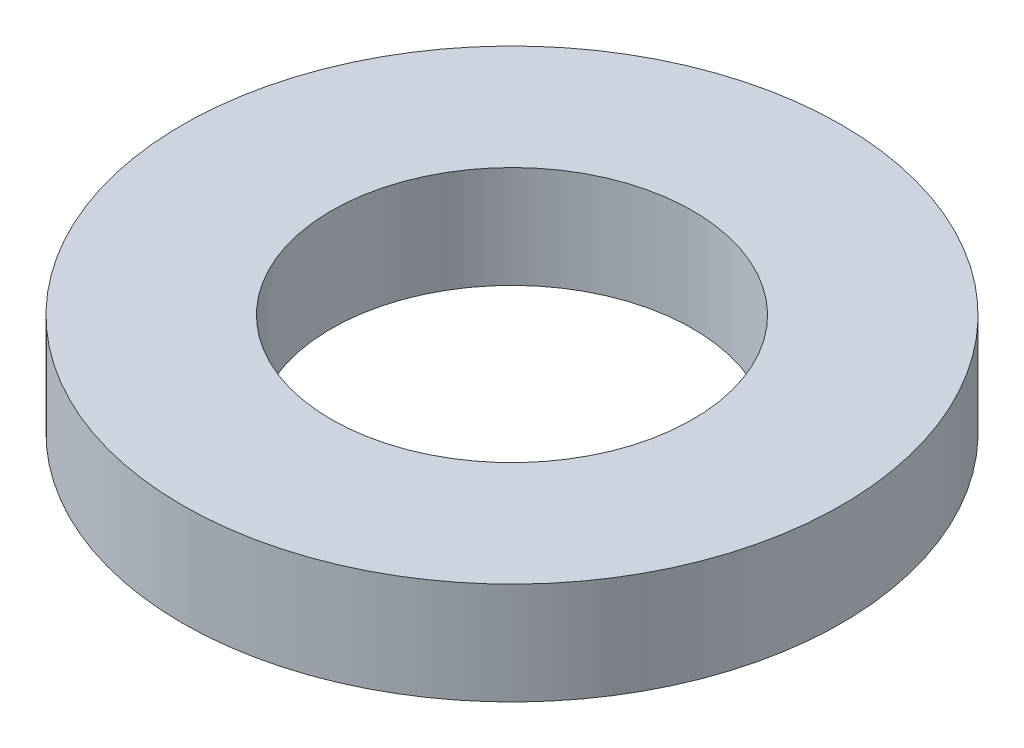
ISO-10303-21;
HEADER;
FILE_DESCRIPTION(('STEP AP214'),'2;1');
FILE_NAME('part.step','',(''),(''),'','','');
FILE_SCHEMA(('AUTOMOTIVE_DESIGN { 1 0 10303 214 1 1 1 1 }'));
ENDSEC;
DATA;
#1=APPLICATION_CONTEXT('core data for automotive mechanical design processes');
#2=APPLICATION_PROTOCOL_DEFINITION('international standard','automotive_design',2000,#1);
#3=PRODUCT_CONTEXT('',#1,'mechanical');
#4=PRODUCT('Part','Part','',(#3));
#5=PRODUCT_RELATED_PRODUCT_CATEGORY('part','',(#4));
#6=PRODUCT_DEFINITION_FORMATION('','',#4);
#7=PRODUCT_DEFINITION_CONTEXT('part definition',#1,'design');
#8=PRODUCT_DEFINITION('design','',#6,#7);
#9=PRODUCT_DEFINITION_SHAPE('','',#8);
#10=(LENGTH_UNIT() NAMED_UNIT(*) SI_UNIT(.MILLI.,.METRE.));
#11=(NAMED_UNIT(*) PLANE_ANGLE_UNIT() SI_UNIT($,.RADIAN.));
#12=(NAMED_UNIT(*) SI_UNIT($,.STERADIAN.) SOLID_ANGLE_UNIT());
#13=UNCERTAINTY_MEASURE_WITH_UNIT(LENGTH_MEASURE(1.E-05),#10,'distance_accuracy_value','');
#14=(GEOMETRIC_REPRESENTATION_CONTEXT(3) GLOBAL_UNCERTAINTY_ASSIGNED_CONTEXT((#13)) GLOBAL_UNIT_ASSIGNED_CONTEXT((#10,
#11,#12)) REPRESENTATION_CONTEXT('',''));
#15=CARTESIAN_POINT('',(0.,0.,0.));
#16=DIRECTION('',(0.,0.,1.));
#17=DIRECTION('',(1.,0.,0.));
#18=AXIS2_PLACEMENT_3D('',#15,#16,#17);
#19=CARTESIAN_POINT('',(0.,24.,0.));
#20=DIRECTION('',(0.,-1.,0.));
#21=DIRECTION('',(0.,0.,-1.));
#22=AXIS2_PLACEMENT_3D('',#19,#20,#21);
#23=CYLINDRICAL_SURFACE('',#22,77.5);
#24=CARTESIAN_POINT('',(0.,24.,0.));
#25=DIRECTION('',(0.,1.,0.));
#26=DIRECTION('',(0.,0.,1.));
#27=AXIS2_PLACEMENT_3D('',#24,#25,#26);
#28=CIRCLE('',#27,77.5);
#29=CARTESIAN_POINT('',(0.,24.,77.5));
#30=VERTEX_POINT('',#29);
#31=EDGE_CURVE('E10',#30,#30,#28,.T.);
#32=ORIENTED_EDGE('',*,*,#31,.F.);
#33=EDGE_LOOP('',(#32));
#34=FACE_BOUND('',#33,.T.);
#35=CARTESIAN_POINT('',(0.,0.,0.));
#36=DIRECTION('',(0.,1.,0.));
#37=DIRECTION('',(0.,0.,1.));
#38=AXIS2_PLACEMENT_3D('',#35,#36,#37);
#39=CIRCLE('',#38,77.5);
#40=CARTESIAN_POINT('',(0.,0.,77.5));
#41=VERTEX_POINT('',#40);
#42=EDGE_CURVE('E37',#41,#41,#39,.T.);
#43=ORIENTED_EDGE('',*,*,#42,.T.);
#44=EDGE_LOOP('',(#43));
#45=FACE_BOUND('',#44,.T.);
#46=ADVANCED_FACE('F40',(#34,#45),#23,.T.);
#47=CARTESIAN_POINT('',(0.,24.,0.));
#48=DIRECTION('',(0.,1.,0.));
#49=DIRECTION('',(0.,0.,1.));
#50=AXIS2_PLACEMENT_3D('',#47,#48,#49);
#51=PLANE('',#50);
#52=CARTESIAN_POINT('',(0.,24.,0.));
#53=DIRECTION('',(0.,1.,0.));
#54=DIRECTION('',(0.,0.,1.));
#55=AXIS2_PLACEMENT_3D('',#52,#53,#54);
#56=CIRCLE('',#55,42.5);
#57=CARTESIAN_POINT('',(0.,24.,42.5));
#58=VERTEX_POINT('',#57);
#59=EDGE_CURVE('E50',#58,#58,#56,.T.);
#60=ORIENTED_EDGE('',*,*,#59,.F.);
#61=EDGE_LOOP('',(#60));
#62=FACE_BOUND('',#61,.T.);
#63=ORIENTED_EDGE('',*,*,#31,.T.);
#64=EDGE_LOOP('',(#63));
#65=FACE_BOUND('',#64,.T.);
#66=ADVANCED_FACE('F59',(#62,#65),#51,.T.);
#67=CARTESIAN_POINT('',(0.,0.,0.));
#68=DIRECTION('',(0.,1.,0.));
#69=DIRECTION('',(0.,0.,1.));
#70=AXIS2_PLACEMENT_3D('',#67,#68,#69);
#71=PLANE('',#70);
#72=CARTESIAN_POINT('',(0.,0.,0.));
#73=DIRECTION('',(0.,1.,0.));
#74=DIRECTION('',(0.,0.,1.));
#75=AXIS2_PLACEMENT_3D('',#72,#73,#74);
#76=CIRCLE('',#75,42.5);
#77=CARTESIAN_POINT('',(0.,0.,42.5));
#78=VERTEX_POINT('',#77);
#79=EDGE_CURVE('E47',#78,#78,#76,.T.);
#80=ORIENTED_EDGE('',*,*,#79,.T.);
#81=EDGE_LOOP('',(#80));
#82=FACE_BOUND('',#81,.T.);
#83=ORIENTED_EDGE('',*,*,#42,.F.);
#84=EDGE_LOOP('',(#83));
#85=FACE_BOUND('',#84,.T.);
#86=ADVANCED_FACE('F58',(#82,#85),#71,.F.);
#87=CARTESIAN_POINT('',(0.,24.,0.));
#88=DIRECTION('',(0.,-1.,0.));
#89=DIRECTION('',(0.,0.,-1.));
#90=AXIS2_PLACEMENT_3D('',#87,#88,#89);
#91=CYLINDRICAL_SURFACE('',#90,42.5);
#92=ORIENTED_EDGE('',*,*,#59,.T.);
#93=EDGE_LOOP('',(#92));
#94=FACE_BOUND('',#93,.T.);
#95=ORIENTED_EDGE('',*,*,#79,.F.);
#96=EDGE_LOOP('',(#95));
#97=FACE_BOUND('',#96,.T.);
#98=ADVANCED_FACE('F54',(#94,#97),#91,.F.);
#99=CLOSED_SHELL('',(#46,#66,#86,#98));
#100=MANIFOLD_SOLID_BREP('B2',#99);
#101=ADVANCED_BREP_SHAPE_REPRESENTATION('',(#18,#100),#14);
#102=SHAPE_DEFINITION_REPRESENTATION(#9,#101);
ENDSEC;
END-ISO-10303-21;
